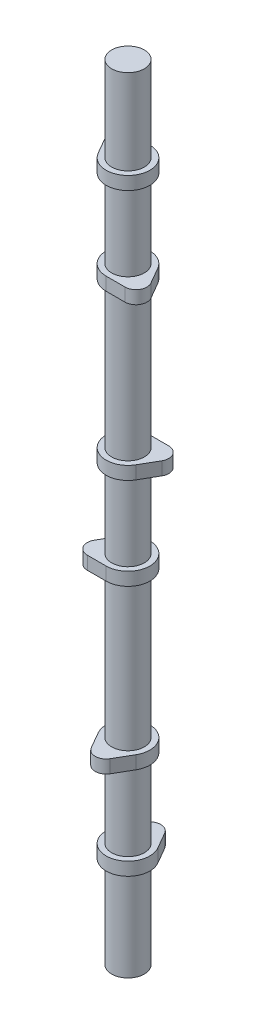
ISO-10303-21;
HEADER;
FILE_DESCRIPTION(('STEP AP214'),'2;1');
FILE_NAME('part.step','',(''),(''),'','','');
FILE_SCHEMA(('AUTOMOTIVE_DESIGN { 1 0 10303 214 1 1 1 1 }'));
ENDSEC;
DATA;
#1=APPLICATION_CONTEXT('core data for automotive mechanical design processes');
#2=APPLICATION_PROTOCOL_DEFINITION('international standard','automotive_design',2000,#1);
#3=PRODUCT_CONTEXT('',#1,'mechanical');
#4=PRODUCT('Part','Part','',(#3));
#5=PRODUCT_RELATED_PRODUCT_CATEGORY('part','',(#4));
#6=PRODUCT_DEFINITION_FORMATION('','',#4);
#7=PRODUCT_DEFINITION_CONTEXT('part definition',#1,'design');
#8=PRODUCT_DEFINITION('design','',#6,#7);
#9=PRODUCT_DEFINITION_SHAPE('','',#8);
#10=(LENGTH_UNIT() NAMED_UNIT(*) SI_UNIT(.MILLI.,.METRE.));
#11=(NAMED_UNIT(*) PLANE_ANGLE_UNIT() SI_UNIT($,.RADIAN.));
#12=(NAMED_UNIT(*) SI_UNIT($,.STERADIAN.) SOLID_ANGLE_UNIT());
#13=UNCERTAINTY_MEASURE_WITH_UNIT(LENGTH_MEASURE(1.E-05),#10,'distance_accuracy_value','');
#14=(GEOMETRIC_REPRESENTATION_CONTEXT(3) GLOBAL_UNCERTAINTY_ASSIGNED_CONTEXT((#13)) GLOBAL_UNIT_ASSIGNED_CONTEXT((#10,
#11,#12)) REPRESENTATION_CONTEXT('',''));
#15=CARTESIAN_POINT('',(0.,0.,0.));
#16=DIRECTION('',(0.,0.,1.));
#17=DIRECTION('',(1.,0.,0.));
#18=AXIS2_PLACEMENT_3D('',#15,#16,#17);
#19=CARTESIAN_POINT('',(0.,353.06,0.));
#20=DIRECTION('',(0.,-1.,0.));
#21=DIRECTION('',(-0.86602540378444,0.,-0.499999999999998));
#22=AXIS2_PLACEMENT_3D('',#19,#20,#21);
#23=CYLINDRICAL_SURFACE('',#22,12.7);
#24=CARTESIAN_POINT('',(0.,345.44,0.));
#25=DIRECTION('',(0.,1.,0.));
#26=DIRECTION('',(0.86602540378444,0.,0.499999999999998));
#27=AXIS2_PLACEMENT_3D('',#24,#25,#26);
#28=CIRCLE('',#27,12.7);
#29=CARTESIAN_POINT('',(-10.9985226280624,345.44,6.35000000000002));
#30=VERTEX_POINT('',#29);
#31=CARTESIAN_POINT('',(0.,345.44,-12.7));
#32=VERTEX_POINT('',#31);
#33=EDGE_CURVE('E129',#30,#32,#28,.T.);
#34=ORIENTED_EDGE('',*,*,#33,.T.);
#35=DIRECTION('',(0.,-1.,0.));
#36=VECTOR('',#35,1.);
#37=CARTESIAN_POINT('',(0.,353.06,-12.7));
#38=LINE('',#37,#36);
#39=CARTESIAN_POINT('',(0.,353.06,-12.7));
#40=VERTEX_POINT('',#39);
#41=EDGE_CURVE('E66',#40,#32,#38,.T.);
#42=ORIENTED_EDGE('',*,*,#41,.F.);
#43=CARTESIAN_POINT('',(0.,353.06,0.));
#44=DIRECTION('',(0.,1.,0.));
#45=DIRECTION('',(0.86602540378444,0.,0.499999999999998));
#46=AXIS2_PLACEMENT_3D('',#43,#44,#45);
#47=CIRCLE('',#46,12.7);
#48=CARTESIAN_POINT('',(-10.9985226280624,353.06,6.35000000000002));
#49=VERTEX_POINT('',#48);
#50=EDGE_CURVE('E111',#49,#40,#47,.T.);
#51=ORIENTED_EDGE('',*,*,#50,.F.);
#52=DIRECTION('',(0.,-1.,0.));
#53=VECTOR('',#52,1.);
#54=CARTESIAN_POINT('',(-10.9985226280624,353.06,6.35000000000002));
#55=LINE('',#54,#53);
#56=EDGE_CURVE('E125',#49,#30,#55,.T.);
#57=ORIENTED_EDGE('',*,*,#56,.T.);
#58=EDGE_LOOP('',(#34,#42,#51,#57));
#59=FACE_BOUND('',#58,.T.);
#60=ADVANCED_FACE('F56',(#59),#23,.T.);
#61=CARTESIAN_POINT('',(-10.9985226280624,353.06,-12.7));
#62=DIRECTION('',(0.,0.,1.));
#63=DIRECTION('',(1.,0.,0.));
#64=AXIS2_PLACEMENT_3D('',#61,#62,#63);
#65=PLANE('',#64);
#66=DIRECTION('',(-1.,0.,0.));
#67=VECTOR('',#66,1.);
#68=CARTESIAN_POINT('',(-10.9985226280624,345.44,-12.7));
#69=LINE('',#68,#67);
#70=CARTESIAN_POINT('',(-10.9985226280624,345.44,-12.7));
#71=VERTEX_POINT('',#70);
#72=EDGE_CURVE('E117',#32,#71,#69,.T.);
#73=ORIENTED_EDGE('',*,*,#72,.T.);
#74=DIRECTION('',(0.,-1.,0.));
#75=VECTOR('',#74,1.);
#76=CARTESIAN_POINT('',(-10.9985226280624,353.06,-12.7));
#77=LINE('',#76,#75);
#78=CARTESIAN_POINT('',(-10.9985226280624,353.06,-12.7));
#79=VERTEX_POINT('',#78);
#80=EDGE_CURVE('E115',#79,#71,#77,.T.);
#81=ORIENTED_EDGE('',*,*,#80,.F.);
#82=DIRECTION('',(-1.,0.,0.));
#83=VECTOR('',#82,1.);
#84=CARTESIAN_POINT('',(-10.9985226280624,353.06,-12.7));
#85=LINE('',#84,#83);
#86=EDGE_CURVE('E106',#40,#79,#85,.T.);
#87=ORIENTED_EDGE('',*,*,#86,.F.);
#88=ORIENTED_EDGE('',*,*,#41,.T.);
#89=EDGE_LOOP('',(#73,#81,#87,#88));
#90=FACE_BOUND('',#89,.T.);
#91=ADVANCED_FACE('F116',(#90),#65,.F.);
#92=CARTESIAN_POINT('',(-10.9985226280624,353.06,-6.34999999999997));
#93=DIRECTION('',(0.,-1.,0.));
#94=DIRECTION('',(-0.86602540378444,0.,-0.499999999999998));
#95=AXIS2_PLACEMENT_3D('',#92,#93,#94);
#96=CYLINDRICAL_SURFACE('',#95,6.35);
#97=CARTESIAN_POINT('',(-10.9985226280624,345.44,-6.34999999999997));
#98=DIRECTION('',(0.,1.,0.));
#99=DIRECTION('',(0.86602540378444,0.,0.499999999999998));
#100=AXIS2_PLACEMENT_3D('',#97,#98,#99);
#101=CIRCLE('',#100,6.35);
#102=CARTESIAN_POINT('',(-16.4977839420936,345.44,-3.17499999999996));
#103=VERTEX_POINT('',#102);
#104=EDGE_CURVE('E92',#71,#103,#101,.T.);
#105=ORIENTED_EDGE('',*,*,#104,.T.);
#106=DIRECTION('',(0.,-1.,0.));
#107=VECTOR('',#106,1.);
#108=CARTESIAN_POINT('',(-16.4977839420936,353.06,-3.17499999999996));
#109=LINE('',#108,#107);
#110=CARTESIAN_POINT('',(-16.4977839420936,353.06,-3.17499999999996));
#111=VERTEX_POINT('',#110);
#112=EDGE_CURVE('E119',#111,#103,#109,.T.);
#113=ORIENTED_EDGE('',*,*,#112,.F.);
#114=CARTESIAN_POINT('',(-10.9985226280624,353.06,-6.34999999999997));
#115=DIRECTION('',(0.,1.,0.));
#116=DIRECTION('',(0.86602540378444,0.,0.499999999999998));
#117=AXIS2_PLACEMENT_3D('',#114,#115,#116);
#118=CIRCLE('',#117,6.35);
#119=EDGE_CURVE('E109',#79,#111,#118,.T.);
#120=ORIENTED_EDGE('',*,*,#119,.F.);
#121=ORIENTED_EDGE('',*,*,#80,.T.);
#122=EDGE_LOOP('',(#105,#113,#120,#121));
#123=FACE_BOUND('',#122,.T.);
#124=ADVANCED_FACE('F121',(#123),#96,.T.);
#125=CARTESIAN_POINT('',(-10.9985226280624,353.06,6.35000000000002));
#126=DIRECTION('',(0.866025403784437,0.,-0.500000000000002));
#127=DIRECTION('',(-0.500000000000002,0.,-0.866025403784438));
#128=AXIS2_PLACEMENT_3D('',#125,#126,#127);
#129=PLANE('',#128);
#130=DIRECTION('',(0.500000000000002,0.,0.866025403784437));
#131=VECTOR('',#130,1.);
#132=CARTESIAN_POINT('',(-10.9985226280624,345.44,6.35000000000002));
#133=LINE('',#132,#131);
#134=EDGE_CURVE('E98',#103,#30,#133,.T.);
#135=ORIENTED_EDGE('',*,*,#134,.T.);
#136=ORIENTED_EDGE('',*,*,#56,.F.);
#137=DIRECTION('',(0.500000000000002,0.,0.866025403784437));
#138=VECTOR('',#137,1.);
#139=CARTESIAN_POINT('',(-10.9985226280624,353.06,6.35000000000002));
#140=LINE('',#139,#138);
#141=EDGE_CURVE('E75',#111,#49,#140,.T.);
#142=ORIENTED_EDGE('',*,*,#141,.F.);
#143=ORIENTED_EDGE('',*,*,#112,.T.);
#144=EDGE_LOOP('',(#135,#136,#142,#143));
#145=FACE_BOUND('',#144,.T.);
#146=ADVANCED_FACE('F158',(#145),#129,.F.);
#147=CARTESIAN_POINT('',(0.,353.06,0.));
#148=DIRECTION('',(0.,1.,0.));
#149=DIRECTION('',(0.86602540378444,0.,0.499999999999998));
#150=AXIS2_PLACEMENT_3D('',#147,#148,#149);
#151=PLANE('',#150);
#152=CARTESIAN_POINT('',(0.,353.06,0.));
#153=DIRECTION('',(0.,1.,0.));
#154=DIRECTION('',(0.,0.,1.));
#155=AXIS2_PLACEMENT_3D('',#152,#153,#154);
#156=CIRCLE('',#155,9.5);
#157=CARTESIAN_POINT('',(0.,353.06,9.5));
#158=VERTEX_POINT('',#157);
#159=EDGE_CURVE('E12',#158,#158,#156,.T.);
#160=ORIENTED_EDGE('',*,*,#159,.F.);
#161=EDGE_LOOP('',(#160));
#162=FACE_BOUND('',#161,.T.);
#163=ORIENTED_EDGE('',*,*,#50,.T.);
#164=ORIENTED_EDGE('',*,*,#86,.T.);
#165=ORIENTED_EDGE('',*,*,#119,.T.);
#166=ORIENTED_EDGE('',*,*,#141,.T.);
#167=EDGE_LOOP('',(#163,#164,#165,#166));
#168=FACE_BOUND('',#167,.T.);
#169=ADVANCED_FACE('F107',(#162,#168),#151,.T.);
#170=CARTESIAN_POINT('',(0.,345.44,0.));
#171=DIRECTION('',(0.,1.,0.));
#172=DIRECTION('',(0.86602540378444,0.,0.499999999999998));
#173=AXIS2_PLACEMENT_3D('',#170,#171,#172);
#174=PLANE('',#173);
#175=CARTESIAN_POINT('',(0.,345.44,0.));
#176=DIRECTION('',(0.,1.,0.));
#177=DIRECTION('',(0.,0.,1.));
#178=AXIS2_PLACEMENT_3D('',#175,#176,#177);
#179=CIRCLE('',#178,9.5);
#180=CARTESIAN_POINT('',(0.,345.44,9.5));
#181=VERTEX_POINT('',#180);
#182=EDGE_CURVE('E59',#181,#181,#179,.T.);
#183=ORIENTED_EDGE('',*,*,#182,.T.);
#184=EDGE_LOOP('',(#183));
#185=FACE_BOUND('',#184,.T.);
#186=ORIENTED_EDGE('',*,*,#33,.F.);
#187=ORIENTED_EDGE('',*,*,#134,.F.);
#188=ORIENTED_EDGE('',*,*,#104,.F.);
#189=ORIENTED_EDGE('',*,*,#72,.F.);
#190=EDGE_LOOP('',(#186,#187,#188,#189));
#191=FACE_BOUND('',#190,.T.);
#192=ADVANCED_FACE('F146',(#185,#191),#174,.F.);
#193=CARTESIAN_POINT('',(0.,-53.4999999999999,0.));
#194=DIRECTION('',(0.,1.,0.));
#195=DIRECTION('',(0.,0.,1.));
#196=AXIS2_PLACEMENT_3D('',#193,#194,#195);
#197=PLANE('',#196);
#198=CARTESIAN_POINT('',(0.,-53.4999999999999,0.));
#199=DIRECTION('',(0.,1.,0.));
#200=DIRECTION('',(0.,0.,1.));
#201=AXIS2_PLACEMENT_3D('',#198,#199,#200);
#202=CIRCLE('',#201,9.5);
#203=CARTESIAN_POINT('',(0.,-53.4999999999999,9.5));
#204=VERTEX_POINT('',#203);
#205=EDGE_CURVE('E225',#204,#204,#202,.T.);
#206=ORIENTED_EDGE('',*,*,#205,.F.);
#207=EDGE_LOOP('',(#206));
#208=FACE_BOUND('',#207,.T.);
#209=ADVANCED_FACE('F148',(#208),#197,.F.);
#210=CARTESIAN_POINT('',(0.,-53.4999999999999,0.));
#211=DIRECTION('',(0.,1.,0.));
#212=DIRECTION('',(0.,0.,1.));
#213=AXIS2_PLACEMENT_3D('',#210,#211,#212);
#214=CYLINDRICAL_SURFACE('',#213,9.5);
#215=ORIENTED_EDGE('',*,*,#205,.T.);
#216=EDGE_LOOP('',(#215));
#217=FACE_BOUND('',#216,.T.);
#218=ORIENTED_EDGE('',*,*,#182,.F.);
#219=EDGE_LOOP('',(#218));
#220=FACE_BOUND('',#219,.T.);
#221=ADVANCED_FACE('F155',(#217,#220),#214,.T.);
#222=ORIENTED_EDGE('',*,*,#159,.T.);
#223=EDGE_LOOP('',(#222));
#224=FACE_BOUND('',#223,.T.);
#225=CARTESIAN_POINT('',(0.,402.59,0.));
#226=DIRECTION('',(0.,1.,0.));
#227=DIRECTION('',(0.,0.,1.));
#228=AXIS2_PLACEMENT_3D('',#225,#226,#227);
#229=CIRCLE('',#228,9.5);
#230=CARTESIAN_POINT('',(0.,402.59,9.5));
#231=VERTEX_POINT('',#230);
#232=EDGE_CURVE('E222',#231,#231,#229,.T.);
#233=ORIENTED_EDGE('',*,*,#232,.F.);
#234=EDGE_LOOP('',(#233));
#235=FACE_BOUND('',#234,.T.);
#236=ADVANCED_FACE('F196',(#224,#235),#214,.T.);
#237=CARTESIAN_POINT('',(0.,402.59,0.));
#238=DIRECTION('',(0.,1.,0.));
#239=DIRECTION('',(0.,0.,1.));
#240=AXIS2_PLACEMENT_3D('',#237,#238,#239);
#241=PLANE('',#240);
#242=ORIENTED_EDGE('',*,*,#232,.T.);
#243=EDGE_LOOP('',(#242));
#244=FACE_BOUND('',#243,.T.);
#245=ADVANCED_FACE('F205',(#244),#241,.T.);
#246=CLOSED_SHELL('',(#60,#91,#124,#146,#169,#192,#209,#221,#236,#245));
#247=MANIFOLD_SOLID_BREP('B2',#246);
#248=CARTESIAN_POINT('',(0.,299.72,0.));
#249=DIRECTION('',(0.,-1.,0.));
#250=DIRECTION('',(0.866025403784443,0.,0.499999999999992));
#251=AXIS2_PLACEMENT_3D('',#248,#249,#250);
#252=CYLINDRICAL_SURFACE('',#251,12.7);
#253=CARTESIAN_POINT('',(0.,292.1,0.));
#254=DIRECTION('',(0.,1.,0.));
#255=DIRECTION('',(-0.866025403784443,0.,-0.499999999999992));
#256=AXIS2_PLACEMENT_3D('',#253,#254,#255);
#257=CIRCLE('',#256,12.7);
#258=CARTESIAN_POINT('',(10.9985226280623,292.1,-6.3500000000001));
#259=VERTEX_POINT('',#258);
#260=CARTESIAN_POINT('',(1.16226472890446E-13,292.1,12.7));
#261=VERTEX_POINT('',#260);
#262=EDGE_CURVE('E328',#259,#261,#257,.T.);
#263=ORIENTED_EDGE('',*,*,#262,.T.);
#264=DIRECTION('',(0.,-1.,0.));
#265=VECTOR('',#264,1.);
#266=CARTESIAN_POINT('',(1.16226472890446E-13,299.72,12.7));
#267=LINE('',#266,#265);
#268=CARTESIAN_POINT('',(1.16226472890446E-13,299.72,12.7));
#269=VERTEX_POINT('',#268);
#270=EDGE_CURVE('E54',#269,#261,#267,.T.);
#271=ORIENTED_EDGE('',*,*,#270,.F.);
#272=CARTESIAN_POINT('',(0.,299.72,0.));
#273=DIRECTION('',(0.,1.,0.));
#274=DIRECTION('',(-0.866025403784443,0.,-0.499999999999992));
#275=AXIS2_PLACEMENT_3D('',#272,#273,#274);
#276=CIRCLE('',#275,12.7);
#277=CARTESIAN_POINT('',(10.9985226280623,299.72,-6.3500000000001));
#278=VERTEX_POINT('',#277);
#279=EDGE_CURVE('E316',#278,#269,#276,.T.);
#280=ORIENTED_EDGE('',*,*,#279,.F.);
#281=DIRECTION('',(0.,-1.,0.));
#282=VECTOR('',#281,1.);
#283=CARTESIAN_POINT('',(10.9985226280623,299.72,-6.3500000000001));
#284=LINE('',#283,#282);
#285=EDGE_CURVE('E324',#278,#259,#284,.T.);
#286=ORIENTED_EDGE('',*,*,#285,.T.);
#287=EDGE_LOOP('',(#263,#271,#280,#286));
#288=FACE_BOUND('',#287,.T.);
#289=ADVANCED_FACE('F265',(#288),#252,.T.);
#290=CARTESIAN_POINT('',(10.9985226280625,299.72,12.6999999999999));
#291=DIRECTION('',(0.,0.,-1.));
#292=DIRECTION('',(-1.,0.,0.));
#293=AXIS2_PLACEMENT_3D('',#290,#291,#292);
#294=PLANE('',#293);
#295=DIRECTION('',(1.,0.,0.));
#296=VECTOR('',#295,1.);
#297=CARTESIAN_POINT('',(10.9985226280625,292.1,12.6999999999999));
#298=LINE('',#297,#296);
#299=CARTESIAN_POINT('',(10.9985226280625,292.1,12.6999999999999));
#300=VERTEX_POINT('',#299);
#301=EDGE_CURVE('E320',#261,#300,#298,.T.);
#302=ORIENTED_EDGE('',*,*,#301,.T.);
#303=DIRECTION('',(0.,-1.,0.));
#304=VECTOR('',#303,1.);
#305=CARTESIAN_POINT('',(10.9985226280625,299.72,12.6999999999999));
#306=LINE('',#305,#304);
#307=CARTESIAN_POINT('',(10.9985226280625,299.72,12.6999999999999));
#308=VERTEX_POINT('',#307);
#309=EDGE_CURVE('E273',#308,#300,#306,.T.);
#310=ORIENTED_EDGE('',*,*,#309,.F.);
#311=DIRECTION('',(1.,0.,0.));
#312=VECTOR('',#311,1.);
#313=CARTESIAN_POINT('',(10.9985226280625,299.72,12.6999999999999));
#314=LINE('',#313,#312);
#315=EDGE_CURVE('E311',#269,#308,#314,.T.);
#316=ORIENTED_EDGE('',*,*,#315,.F.);
#317=ORIENTED_EDGE('',*,*,#270,.T.);
#318=EDGE_LOOP('',(#302,#310,#316,#317));
#319=FACE_BOUND('',#318,.T.);
#320=ADVANCED_FACE('F319',(#319),#294,.F.);
#321=CARTESIAN_POINT('',(10.9985226280624,299.72,6.3499999999999));
#322=DIRECTION('',(0.,-1.,0.));
#323=DIRECTION('',(0.866025403784443,0.,0.499999999999992));
#324=AXIS2_PLACEMENT_3D('',#321,#322,#323);
#325=CYLINDRICAL_SURFACE('',#324,6.35);
#326=CARTESIAN_POINT('',(10.9985226280624,292.1,6.3499999999999));
#327=DIRECTION('',(0.,1.,0.));
#328=DIRECTION('',(-0.866025403784443,0.,-0.499999999999992));
#329=AXIS2_PLACEMENT_3D('',#326,#327,#328);
#330=CIRCLE('',#329,6.35);
#331=CARTESIAN_POINT('',(16.4977839420936,292.1,3.17499999999985));
#332=VERTEX_POINT('',#331);
#333=EDGE_CURVE('E298',#300,#332,#330,.T.);
#334=ORIENTED_EDGE('',*,*,#333,.T.);
#335=DIRECTION('',(0.,-1.,0.));
#336=VECTOR('',#335,1.);
#337=CARTESIAN_POINT('',(16.4977839420936,299.72,3.17499999999985));
#338=LINE('',#337,#336);
#339=CARTESIAN_POINT('',(16.4977839420936,299.72,3.17499999999985));
#340=VERTEX_POINT('',#339);
#341=EDGE_CURVE('E321',#340,#332,#338,.T.);
#342=ORIENTED_EDGE('',*,*,#341,.F.);
#343=CARTESIAN_POINT('',(10.9985226280624,299.72,6.3499999999999));
#344=DIRECTION('',(0.,1.,0.));
#345=DIRECTION('',(-0.866025403784443,0.,-0.499999999999992));
#346=AXIS2_PLACEMENT_3D('',#343,#344,#345);
#347=CIRCLE('',#346,6.35);
#348=EDGE_CURVE('E314',#308,#340,#347,.T.);
#349=ORIENTED_EDGE('',*,*,#348,.F.);
#350=ORIENTED_EDGE('',*,*,#309,.T.);
#351=EDGE_LOOP('',(#334,#342,#349,#350));
#352=FACE_BOUND('',#351,.T.);
#353=ADVANCED_FACE('F322',(#352),#325,.T.);
#354=CARTESIAN_POINT('',(10.9985226280623,299.72,-6.3500000000001));
#355=DIRECTION('',(-0.866025403784434,0.,0.500000000000008));
#356=DIRECTION('',(0.500000000000008,0.,0.866025403784434));
#357=AXIS2_PLACEMENT_3D('',#354,#355,#356);
#358=PLANE('',#357);
#359=DIRECTION('',(-0.500000000000008,0.,-0.866025403784434));
#360=VECTOR('',#359,1.);
#361=CARTESIAN_POINT('',(10.9985226280623,292.1,-6.3500000000001));
#362=LINE('',#361,#360);
#363=EDGE_CURVE('E304',#332,#259,#362,.T.);
#364=ORIENTED_EDGE('',*,*,#363,.T.);
#365=ORIENTED_EDGE('',*,*,#285,.F.);
#366=DIRECTION('',(-0.500000000000008,0.,-0.866025403784434));
#367=VECTOR('',#366,1.);
#368=CARTESIAN_POINT('',(10.9985226280623,299.72,-6.3500000000001));
#369=LINE('',#368,#367);
#370=EDGE_CURVE('E281',#340,#278,#369,.T.);
#371=ORIENTED_EDGE('',*,*,#370,.F.);
#372=ORIENTED_EDGE('',*,*,#341,.T.);
#373=EDGE_LOOP('',(#364,#365,#371,#372));
#374=FACE_BOUND('',#373,.T.);
#375=ADVANCED_FACE('F335',(#374),#358,.F.);
#376=CARTESIAN_POINT('',(0.,299.72,0.));
#377=DIRECTION('',(0.,1.,0.));
#378=DIRECTION('',(-0.866025403784443,0.,-0.499999999999992));
#379=AXIS2_PLACEMENT_3D('',#376,#377,#378);
#380=PLANE('',#379);
#381=ORIENTED_EDGE('',*,*,#279,.T.);
#382=ORIENTED_EDGE('',*,*,#315,.T.);
#383=ORIENTED_EDGE('',*,*,#348,.T.);
#384=ORIENTED_EDGE('',*,*,#370,.T.);
#385=EDGE_LOOP('',(#381,#382,#383,#384));
#386=FACE_BOUND('',#385,.T.);
#387=ADVANCED_FACE('F312',(#386),#380,.T.);
#388=CARTESIAN_POINT('',(0.,292.1,0.));
#389=DIRECTION('',(0.,1.,0.));
#390=DIRECTION('',(-0.866025403784443,0.,-0.499999999999992));
#391=AXIS2_PLACEMENT_3D('',#388,#389,#390);
#392=PLANE('',#391);
#393=ORIENTED_EDGE('',*,*,#262,.F.);
#394=ORIENTED_EDGE('',*,*,#363,.F.);
#395=ORIENTED_EDGE('',*,*,#333,.F.);
#396=ORIENTED_EDGE('',*,*,#301,.F.);
#397=EDGE_LOOP('',(#393,#394,#395,#396));
#398=FACE_BOUND('',#397,.T.);
#399=ADVANCED_FACE('F338',(#398),#392,.F.);
#400=CLOSED_SHELL('',(#289,#320,#353,#375,#387,#399));
#401=MANIFOLD_SOLID_BREP('B6',#400);
#402=CARTESIAN_POINT('',(0.,207.01,0.));
#403=DIRECTION('',(0.,-1.,0.));
#404=DIRECTION('',(0.866025403784419,0.,-0.500000000000034));
#405=AXIS2_PLACEMENT_3D('',#402,#403,#404);
#406=CYLINDRICAL_SURFACE('',#405,12.7);
#407=CARTESIAN_POINT('',(0.,199.39,0.));
#408=DIRECTION('',(0.,1.,0.));
#409=DIRECTION('',(-0.866025403784419,0.,0.500000000000034));
#410=AXIS2_PLACEMENT_3D('',#407,#408,#409);
#411=CIRCLE('',#410,12.7);
#412=CARTESIAN_POINT('',(-4.9960036108132E-13,199.39,-12.7));
#413=VERTEX_POINT('',#412);
#414=CARTESIAN_POINT('',(10.9985226280626,199.39,6.34999999999957));
#415=VERTEX_POINT('',#414);
#416=EDGE_CURVE('E462',#413,#415,#411,.T.);
#417=ORIENTED_EDGE('',*,*,#416,.T.);
#418=DIRECTION('',(0.,-1.,0.));
#419=VECTOR('',#418,1.);
#420=CARTESIAN_POINT('',(10.9985226280626,207.01,6.34999999999957));
#421=LINE('',#420,#419);
#422=CARTESIAN_POINT('',(10.9985226280626,207.01,6.34999999999957));
#423=VERTEX_POINT('',#422);
#424=EDGE_CURVE('E263',#423,#415,#421,.T.);
#425=ORIENTED_EDGE('',*,*,#424,.F.);
#426=CARTESIAN_POINT('',(0.,207.01,0.));
#427=DIRECTION('',(0.,1.,0.));
#428=DIRECTION('',(-0.866025403784419,0.,0.500000000000034));
#429=AXIS2_PLACEMENT_3D('',#426,#427,#428);
#430=CIRCLE('',#429,12.7);
#431=CARTESIAN_POINT('',(-4.9960036108132E-13,207.01,-12.7));
#432=VERTEX_POINT('',#431);
#433=EDGE_CURVE('E450',#432,#423,#430,.T.);
#434=ORIENTED_EDGE('',*,*,#433,.F.);
#435=DIRECTION('',(0.,-1.,0.));
#436=VECTOR('',#435,1.);
#437=CARTESIAN_POINT('',(-4.9960036108132E-13,207.01,-12.7));
#438=LINE('',#437,#436);
#439=EDGE_CURVE('E458',#432,#413,#438,.T.);
#440=ORIENTED_EDGE('',*,*,#439,.T.);
#441=EDGE_LOOP('',(#417,#425,#434,#440));
#442=FACE_BOUND('',#441,.T.);
#443=ADVANCED_FACE('F399',(#442),#406,.T.);
#444=CARTESIAN_POINT('',(16.4977839420934,207.01,-3.17500000000065));
#445=DIRECTION('',(-0.866025403784458,0.,-0.499999999999966));
#446=DIRECTION('',(-0.499999999999966,0.,0.866025403784458));
#447=AXIS2_PLACEMENT_3D('',#444,#445,#446);
#448=PLANE('',#447);
#449=DIRECTION('',(0.499999999999966,0.,-0.866025403784458));
#450=VECTOR('',#449,1.);
#451=CARTESIAN_POINT('',(16.4977839420934,199.39,-3.17500000000065));
#452=LINE('',#451,#450);
#453=CARTESIAN_POINT('',(16.4977839420934,199.39,-3.17500000000065));
#454=VERTEX_POINT('',#453);
#455=EDGE_CURVE('E454',#415,#454,#452,.T.);
#456=ORIENTED_EDGE('',*,*,#455,.T.);
#457=DIRECTION('',(0.,-1.,0.));
#458=VECTOR('',#457,1.);
#459=CARTESIAN_POINT('',(16.4977839420934,207.01,-3.17500000000065));
#460=LINE('',#459,#458);
#461=CARTESIAN_POINT('',(16.4977839420934,207.01,-3.17500000000065));
#462=VERTEX_POINT('',#461);
#463=EDGE_CURVE('E407',#462,#454,#460,.T.);
#464=ORIENTED_EDGE('',*,*,#463,.F.);
#465=DIRECTION('',(0.499999999999966,0.,-0.866025403784458));
#466=VECTOR('',#465,1.);
#467=CARTESIAN_POINT('',(16.4977839420934,207.01,-3.17500000000065));
#468=LINE('',#467,#466);
#469=EDGE_CURVE('E445',#423,#462,#468,.T.);
#470=ORIENTED_EDGE('',*,*,#469,.F.);
#471=ORIENTED_EDGE('',*,*,#424,.T.);
#472=EDGE_LOOP('',(#456,#464,#470,#471));
#473=FACE_BOUND('',#472,.T.);
#474=ADVANCED_FACE('F453',(#473),#448,.F.);
#475=CARTESIAN_POINT('',(10.9985226280621,207.01,-6.35000000000043));
#476=DIRECTION('',(0.,-1.,0.));
#477=DIRECTION('',(0.866025403784419,0.,-0.500000000000034));
#478=AXIS2_PLACEMENT_3D('',#475,#476,#477);
#479=CYLINDRICAL_SURFACE('',#478,6.35);
#480=CARTESIAN_POINT('',(10.9985226280621,199.39,-6.35000000000043));
#481=DIRECTION('',(0.,1.,0.));
#482=DIRECTION('',(-0.866025403784419,0.,0.500000000000034));
#483=AXIS2_PLACEMENT_3D('',#480,#481,#482);
#484=CIRCLE('',#483,6.35);
#485=CARTESIAN_POINT('',(10.9985226280619,199.39,-12.7000000000004));
#486=VERTEX_POINT('',#485);
#487=EDGE_CURVE('E432',#454,#486,#484,.T.);
#488=ORIENTED_EDGE('',*,*,#487,.T.);
#489=DIRECTION('',(0.,-1.,0.));
#490=VECTOR('',#489,1.);
#491=CARTESIAN_POINT('',(10.9985226280619,207.01,-12.7000000000004));
#492=LINE('',#491,#490);
#493=CARTESIAN_POINT('',(10.9985226280619,207.01,-12.7000000000004));
#494=VERTEX_POINT('',#493);
#495=EDGE_CURVE('E455',#494,#486,#492,.T.);
#496=ORIENTED_EDGE('',*,*,#495,.F.);
#497=CARTESIAN_POINT('',(10.9985226280621,207.01,-6.35000000000043));
#498=DIRECTION('',(0.,1.,0.));
#499=DIRECTION('',(-0.866025403784419,0.,0.500000000000034));
#500=AXIS2_PLACEMENT_3D('',#497,#498,#499);
#501=CIRCLE('',#500,6.35);
#502=EDGE_CURVE('E448',#462,#494,#501,.T.);
#503=ORIENTED_EDGE('',*,*,#502,.F.);
#504=ORIENTED_EDGE('',*,*,#463,.T.);
#505=EDGE_LOOP('',(#488,#496,#503,#504));
#506=FACE_BOUND('',#505,.T.);
#507=ADVANCED_FACE('F456',(#506),#479,.T.);
#508=CARTESIAN_POINT('',(-4.9960036108132E-13,207.01,-12.7));
#509=DIRECTION('',(0.,0.,1.));
#510=DIRECTION('',(1.,0.,0.));
#511=AXIS2_PLACEMENT_3D('',#508,#509,#510);
#512=PLANE('',#511);
#513=DIRECTION('',(-1.,0.,0.));
#514=VECTOR('',#513,1.);
#515=CARTESIAN_POINT('',(-4.9960036108132E-13,199.39,-12.7));
#516=LINE('',#515,#514);
#517=EDGE_CURVE('E438',#486,#413,#516,.T.);
#518=ORIENTED_EDGE('',*,*,#517,.T.);
#519=ORIENTED_EDGE('',*,*,#439,.F.);
#520=DIRECTION('',(-1.,0.,0.));
#521=VECTOR('',#520,1.);
#522=CARTESIAN_POINT('',(-4.9960036108132E-13,207.01,-12.7));
#523=LINE('',#522,#521);
#524=EDGE_CURVE('E415',#494,#432,#523,.T.);
#525=ORIENTED_EDGE('',*,*,#524,.F.);
#526=ORIENTED_EDGE('',*,*,#495,.T.);
#527=EDGE_LOOP('',(#518,#519,#525,#526));
#528=FACE_BOUND('',#527,.T.);
#529=ADVANCED_FACE('F469',(#528),#512,.F.);
#530=CARTESIAN_POINT('',(0.,207.01,0.));
#531=DIRECTION('',(0.,1.,0.));
#532=DIRECTION('',(-0.866025403784419,0.,0.500000000000034));
#533=AXIS2_PLACEMENT_3D('',#530,#531,#532);
#534=PLANE('',#533);
#535=ORIENTED_EDGE('',*,*,#433,.T.);
#536=ORIENTED_EDGE('',*,*,#469,.T.);
#537=ORIENTED_EDGE('',*,*,#502,.T.);
#538=ORIENTED_EDGE('',*,*,#524,.T.);
#539=EDGE_LOOP('',(#535,#536,#537,#538));
#540=FACE_BOUND('',#539,.T.);
#541=ADVANCED_FACE('F446',(#540),#534,.T.);
#542=CARTESIAN_POINT('',(0.,199.39,0.));
#543=DIRECTION('',(0.,1.,0.));
#544=DIRECTION('',(-0.866025403784419,0.,0.500000000000034));
#545=AXIS2_PLACEMENT_3D('',#542,#543,#544);
#546=PLANE('',#545);
#547=ORIENTED_EDGE('',*,*,#416,.F.);
#548=ORIENTED_EDGE('',*,*,#517,.F.);
#549=ORIENTED_EDGE('',*,*,#487,.F.);
#550=ORIENTED_EDGE('',*,*,#455,.F.);
#551=EDGE_LOOP('',(#547,#548,#549,#550));
#552=FACE_BOUND('',#551,.T.);
#553=ADVANCED_FACE('F472',(#552),#546,.F.);
#554=CLOSED_SHELL('',(#443,#474,#507,#529,#541,#553));
#555=MANIFOLD_SOLID_BREP('B48',#554);
#556=CARTESIAN_POINT('',(0.,153.67,0.));
#557=DIRECTION('',(0.,-1.,0.));
#558=DIRECTION('',(-0.866025403784415,0.,0.50000000000004));
#559=AXIS2_PLACEMENT_3D('',#556,#557,#558);
#560=CYLINDRICAL_SURFACE('',#559,12.7);
#561=CARTESIAN_POINT('',(0.,146.05,0.));
#562=DIRECTION('',(0.,1.,0.));
#563=DIRECTION('',(0.866025403784415,0.,-0.50000000000004));
#564=AXIS2_PLACEMENT_3D('',#561,#562,#563);
#565=CIRCLE('',#564,12.7);
#566=CARTESIAN_POINT('',(5.88938620094126E-13,146.05,12.7));
#567=VERTEX_POINT('',#566);
#568=CARTESIAN_POINT('',(-10.9985226280627,146.05,-6.34999999999949));
#569=VERTEX_POINT('',#568);
#570=EDGE_CURVE('E596',#567,#569,#565,.T.);
#571=ORIENTED_EDGE('',*,*,#570,.T.);
#572=DIRECTION('',(0.,-1.,0.));
#573=VECTOR('',#572,1.);
#574=CARTESIAN_POINT('',(-10.9985226280627,153.67,-6.34999999999949));
#575=LINE('',#574,#573);
#576=CARTESIAN_POINT('',(-10.9985226280627,153.67,-6.34999999999949));
#577=VERTEX_POINT('',#576);
#578=EDGE_CURVE('E397',#577,#569,#575,.T.);
#579=ORIENTED_EDGE('',*,*,#578,.F.);
#580=CARTESIAN_POINT('',(0.,153.67,0.));
#581=DIRECTION('',(0.,1.,0.));
#582=DIRECTION('',(0.866025403784415,0.,-0.50000000000004));
#583=AXIS2_PLACEMENT_3D('',#580,#581,#582);
#584=CIRCLE('',#583,12.7);
#585=CARTESIAN_POINT('',(5.88938620094126E-13,153.67,12.7));
#586=VERTEX_POINT('',#585);
#587=EDGE_CURVE('E584',#586,#577,#584,.T.);
#588=ORIENTED_EDGE('',*,*,#587,.F.);
#589=DIRECTION('',(0.,-1.,0.));
#590=VECTOR('',#589,1.);
#591=CARTESIAN_POINT('',(5.88938620094126E-13,153.67,12.7));
#592=LINE('',#591,#590);
#593=EDGE_CURVE('E592',#586,#567,#592,.T.);
#594=ORIENTED_EDGE('',*,*,#593,.T.);
#595=EDGE_LOOP('',(#571,#579,#588,#594));
#596=FACE_BOUND('',#595,.T.);
#597=ADVANCED_FACE('F533',(#596),#560,.T.);
#598=CARTESIAN_POINT('',(-16.4977839420934,153.67,3.17500000000077));
#599=DIRECTION('',(0.866025403784462,0.,0.49999999999996));
#600=DIRECTION('',(0.49999999999996,0.,-0.866025403784462));
#601=AXIS2_PLACEMENT_3D('',#598,#599,#600);
#602=PLANE('',#601);
#603=DIRECTION('',(-0.49999999999996,0.,0.866025403784462));
#604=VECTOR('',#603,1.);
#605=CARTESIAN_POINT('',(-16.4977839420934,146.05,3.17500000000077));
#606=LINE('',#605,#604);
#607=CARTESIAN_POINT('',(-16.4977839420934,146.05,3.17500000000077));
#608=VERTEX_POINT('',#607);
#609=EDGE_CURVE('E588',#569,#608,#606,.T.);
#610=ORIENTED_EDGE('',*,*,#609,.T.);
#611=DIRECTION('',(0.,-1.,0.));
#612=VECTOR('',#611,1.);
#613=CARTESIAN_POINT('',(-16.4977839420934,153.67,3.17500000000077));
#614=LINE('',#613,#612);
#615=CARTESIAN_POINT('',(-16.4977839420934,153.67,3.17500000000077));
#616=VERTEX_POINT('',#615);
#617=EDGE_CURVE('E541',#616,#608,#614,.T.);
#618=ORIENTED_EDGE('',*,*,#617,.F.);
#619=DIRECTION('',(-0.49999999999996,0.,0.866025403784462));
#620=VECTOR('',#619,1.);
#621=CARTESIAN_POINT('',(-16.4977839420934,153.67,3.17500000000077));
#622=LINE('',#621,#620);
#623=EDGE_CURVE('E579',#577,#616,#622,.T.);
#624=ORIENTED_EDGE('',*,*,#623,.F.);
#625=ORIENTED_EDGE('',*,*,#578,.T.);
#626=EDGE_LOOP('',(#610,#618,#624,#625));
#627=FACE_BOUND('',#626,.T.);
#628=ADVANCED_FACE('F587',(#627),#602,.F.);
#629=CARTESIAN_POINT('',(-10.9985226280621,153.67,6.35000000000051));
#630=DIRECTION('',(0.,-1.,0.));
#631=DIRECTION('',(-0.866025403784415,0.,0.50000000000004));
#632=AXIS2_PLACEMENT_3D('',#629,#630,#631);
#633=CYLINDRICAL_SURFACE('',#632,6.35);
#634=CARTESIAN_POINT('',(-10.9985226280621,146.05,6.35000000000051));
#635=DIRECTION('',(0.,1.,0.));
#636=DIRECTION('',(0.866025403784415,0.,-0.50000000000004));
#637=AXIS2_PLACEMENT_3D('',#634,#635,#636);
#638=CIRCLE('',#637,6.35);
#639=CARTESIAN_POINT('',(-10.9985226280618,146.05,12.7000000000005));
#640=VERTEX_POINT('',#639);
#641=EDGE_CURVE('E566',#608,#640,#638,.T.);
#642=ORIENTED_EDGE('',*,*,#641,.T.);
#643=DIRECTION('',(0.,-1.,0.));
#644=VECTOR('',#643,1.);
#645=CARTESIAN_POINT('',(-10.9985226280618,153.67,12.7000000000005));
#646=LINE('',#645,#644);
#647=CARTESIAN_POINT('',(-10.9985226280618,153.67,12.7000000000005));
#648=VERTEX_POINT('',#647);
#649=EDGE_CURVE('E589',#648,#640,#646,.T.);
#650=ORIENTED_EDGE('',*,*,#649,.F.);
#651=CARTESIAN_POINT('',(-10.9985226280621,153.67,6.35000000000051));
#652=DIRECTION('',(0.,1.,0.));
#653=DIRECTION('',(0.866025403784415,0.,-0.50000000000004));
#654=AXIS2_PLACEMENT_3D('',#651,#652,#653);
#655=CIRCLE('',#654,6.35);
#656=EDGE_CURVE('E582',#616,#648,#655,.T.);
#657=ORIENTED_EDGE('',*,*,#656,.F.);
#658=ORIENTED_EDGE('',*,*,#617,.T.);
#659=EDGE_LOOP('',(#642,#650,#657,#658));
#660=FACE_BOUND('',#659,.T.);
#661=ADVANCED_FACE('F590',(#660),#633,.T.);
#662=CARTESIAN_POINT('',(5.88938620094126E-13,153.67,12.7));
#663=DIRECTION('',(0.,0.,-1.));
#664=DIRECTION('',(-1.,0.,0.));
#665=AXIS2_PLACEMENT_3D('',#662,#663,#664);
#666=PLANE('',#665);
#667=DIRECTION('',(1.,0.,0.));
#668=VECTOR('',#667,1.);
#669=CARTESIAN_POINT('',(5.88938620094126E-13,146.05,12.7));
#670=LINE('',#669,#668);
#671=EDGE_CURVE('E572',#640,#567,#670,.T.);
#672=ORIENTED_EDGE('',*,*,#671,.T.);
#673=ORIENTED_EDGE('',*,*,#593,.F.);
#674=DIRECTION('',(1.,0.,0.));
#675=VECTOR('',#674,1.);
#676=CARTESIAN_POINT('',(5.88938620094126E-13,153.67,12.7));
#677=LINE('',#676,#675);
#678=EDGE_CURVE('E549',#648,#586,#677,.T.);
#679=ORIENTED_EDGE('',*,*,#678,.F.);
#680=ORIENTED_EDGE('',*,*,#649,.T.);
#681=EDGE_LOOP('',(#672,#673,#679,#680));
#682=FACE_BOUND('',#681,.T.);
#683=ADVANCED_FACE('F603',(#682),#666,.F.);
#684=CARTESIAN_POINT('',(0.,153.67,0.));
#685=DIRECTION('',(0.,1.,0.));
#686=DIRECTION('',(0.866025403784415,0.,-0.50000000000004));
#687=AXIS2_PLACEMENT_3D('',#684,#685,#686);
#688=PLANE('',#687);
#689=ORIENTED_EDGE('',*,*,#587,.T.);
#690=ORIENTED_EDGE('',*,*,#623,.T.);
#691=ORIENTED_EDGE('',*,*,#656,.T.);
#692=ORIENTED_EDGE('',*,*,#678,.T.);
#693=EDGE_LOOP('',(#689,#690,#691,#692));
#694=FACE_BOUND('',#693,.T.);
#695=ADVANCED_FACE('F580',(#694),#688,.T.);
#696=CARTESIAN_POINT('',(0.,146.05,0.));
#697=DIRECTION('',(0.,1.,0.));
#698=DIRECTION('',(0.866025403784415,0.,-0.50000000000004));
#699=AXIS2_PLACEMENT_3D('',#696,#697,#698);
#700=PLANE('',#699);
#701=ORIENTED_EDGE('',*,*,#570,.F.);
#702=ORIENTED_EDGE('',*,*,#671,.F.);
#703=ORIENTED_EDGE('',*,*,#641,.F.);
#704=ORIENTED_EDGE('',*,*,#609,.F.);
#705=EDGE_LOOP('',(#701,#702,#703,#704));
#706=FACE_BOUND('',#705,.T.);
#707=ADVANCED_FACE('F606',(#706),#700,.F.);
#708=CLOSED_SHELL('',(#597,#628,#661,#683,#695,#707));
#709=MANIFOLD_SOLID_BREP('B257',#708);
#710=CARTESIAN_POINT('',(0.,60.96,0.));
#711=DIRECTION('',(0.,-1.,0.));
#712=DIRECTION('',(0.,0.,1.));
#713=AXIS2_PLACEMENT_3D('',#710,#711,#712);
#714=CYLINDRICAL_SURFACE('',#713,12.7);
#715=CARTESIAN_POINT('',(0.,53.34,0.));
#716=DIRECTION('',(0.,1.,0.));
#717=DIRECTION('',(0.,0.,-1.));
#718=AXIS2_PLACEMENT_3D('',#715,#716,#717);
#719=CIRCLE('',#718,12.7);
#720=CARTESIAN_POINT('',(10.9985226280623,53.34,6.35000000000008));
#721=VERTEX_POINT('',#720);
#722=CARTESIAN_POINT('',(-10.9985226280624,53.34,6.34999999999992));
#723=VERTEX_POINT('',#722);
#724=EDGE_CURVE('E729',#721,#723,#719,.T.);
#725=ORIENTED_EDGE('',*,*,#724,.T.);
#726=DIRECTION('',(0.,-1.,0.));
#727=VECTOR('',#726,1.);
#728=CARTESIAN_POINT('',(-10.9985226280624,60.96,6.34999999999992));
#729=LINE('',#728,#727);
#730=CARTESIAN_POINT('',(-10.9985226280624,60.96,6.34999999999992));
#731=VERTEX_POINT('',#730);
#732=EDGE_CURVE('E531',#731,#723,#729,.T.);
#733=ORIENTED_EDGE('',*,*,#732,.F.);
#734=CARTESIAN_POINT('',(0.,60.96,0.));
#735=DIRECTION('',(0.,1.,0.));
#736=DIRECTION('',(0.,0.,-1.));
#737=AXIS2_PLACEMENT_3D('',#734,#735,#736);
#738=CIRCLE('',#737,12.7);
#739=CARTESIAN_POINT('',(10.9985226280623,60.96,6.35000000000008));
#740=VERTEX_POINT('',#739);
#741=EDGE_CURVE('E717',#740,#731,#738,.T.);
#742=ORIENTED_EDGE('',*,*,#741,.F.);
#743=DIRECTION('',(0.,-1.,0.));
#744=VECTOR('',#743,1.);
#745=CARTESIAN_POINT('',(10.9985226280623,60.96,6.35000000000008));
#746=LINE('',#745,#744);
#747=EDGE_CURVE('E725',#740,#721,#746,.T.);
#748=ORIENTED_EDGE('',*,*,#747,.T.);
#749=EDGE_LOOP('',(#725,#733,#742,#748));
#750=FACE_BOUND('',#749,.T.);
#751=ADVANCED_FACE('F666',(#750),#714,.T.);
#752=CARTESIAN_POINT('',(-5.4992613140313,60.96,15.875));
#753=DIRECTION('',(0.866025403784442,0.,-0.499999999999994));
#754=DIRECTION('',(-0.499999999999994,0.,-0.866025403784442));
#755=AXIS2_PLACEMENT_3D('',#752,#753,#754);
#756=PLANE('',#755);
#757=DIRECTION('',(0.499999999999994,0.,0.866025403784442));
#758=VECTOR('',#757,1.);
#759=CARTESIAN_POINT('',(-5.4992613140313,53.34,15.875));
#760=LINE('',#759,#758);
#761=CARTESIAN_POINT('',(-5.4992613140313,53.34,15.875));
#762=VERTEX_POINT('',#761);
#763=EDGE_CURVE('E721',#723,#762,#760,.T.);
#764=ORIENTED_EDGE('',*,*,#763,.T.);
#765=DIRECTION('',(0.,-1.,0.));
#766=VECTOR('',#765,1.);
#767=CARTESIAN_POINT('',(-5.4992613140313,60.96,15.875));
#768=LINE('',#767,#766);
#769=CARTESIAN_POINT('',(-5.4992613140313,60.96,15.875));
#770=VERTEX_POINT('',#769);
#771=EDGE_CURVE('E674',#770,#762,#768,.T.);
#772=ORIENTED_EDGE('',*,*,#771,.F.);
#773=DIRECTION('',(0.499999999999994,0.,0.866025403784442));
#774=VECTOR('',#773,1.);
#775=CARTESIAN_POINT('',(-5.4992613140313,60.96,15.875));
#776=LINE('',#775,#774);
#777=EDGE_CURVE('E712',#731,#770,#776,.T.);
#778=ORIENTED_EDGE('',*,*,#777,.F.);
#779=ORIENTED_EDGE('',*,*,#732,.T.);
#780=EDGE_LOOP('',(#764,#772,#778,#779));
#781=FACE_BOUND('',#780,.T.);
#782=ADVANCED_FACE('F720',(#781),#756,.F.);
#783=CARTESIAN_POINT('',(0.,60.96,12.7));
#784=DIRECTION('',(0.,-1.,0.));
#785=DIRECTION('',(0.,0.,1.));
#786=AXIS2_PLACEMENT_3D('',#783,#784,#785);
#787=CYLINDRICAL_SURFACE('',#786,6.35);
#788=CARTESIAN_POINT('',(0.,53.34,12.7));
#789=DIRECTION('',(0.,1.,0.));
#790=DIRECTION('',(0.,0.,-1.));
#791=AXIS2_PLACEMENT_3D('',#788,#789,#790);
#792=CIRCLE('',#791,6.35);
#793=CARTESIAN_POINT('',(5.49926131403107,53.34,15.875));
#794=VERTEX_POINT('',#793);
#795=EDGE_CURVE('E699',#762,#794,#792,.T.);
#796=ORIENTED_EDGE('',*,*,#795,.T.);
#797=DIRECTION('',(0.,-1.,0.));
#798=VECTOR('',#797,1.);
#799=CARTESIAN_POINT('',(5.49926131403107,60.96,15.875));
#800=LINE('',#799,#798);
#801=CARTESIAN_POINT('',(5.49926131403107,60.96,15.875));
#802=VERTEX_POINT('',#801);
#803=EDGE_CURVE('E722',#802,#794,#800,.T.);
#804=ORIENTED_EDGE('',*,*,#803,.F.);
#805=CARTESIAN_POINT('',(0.,60.96,12.7));
#806=DIRECTION('',(0.,1.,0.));
#807=DIRECTION('',(0.,0.,-1.));
#808=AXIS2_PLACEMENT_3D('',#805,#806,#807);
#809=CIRCLE('',#808,6.35);
#810=EDGE_CURVE('E715',#770,#802,#809,.T.);
#811=ORIENTED_EDGE('',*,*,#810,.F.);
#812=ORIENTED_EDGE('',*,*,#771,.T.);
#813=EDGE_LOOP('',(#796,#804,#811,#812));
#814=FACE_BOUND('',#813,.T.);
#815=ADVANCED_FACE('F723',(#814),#787,.T.);
#816=CARTESIAN_POINT('',(10.9985226280623,60.96,6.35000000000008));
#817=DIRECTION('',(-0.866025403784435,0.,-0.500000000000006));
#818=DIRECTION('',(-0.500000000000006,0.,0.866025403784435));
#819=AXIS2_PLACEMENT_3D('',#816,#817,#818);
#820=PLANE('',#819);
#821=DIRECTION('',(0.500000000000006,0.,-0.866025403784435));
#822=VECTOR('',#821,1.);
#823=CARTESIAN_POINT('',(10.9985226280623,53.34,6.35000000000008));
#824=LINE('',#823,#822);
#825=EDGE_CURVE('E705',#794,#721,#824,.T.);
#826=ORIENTED_EDGE('',*,*,#825,.T.);
#827=ORIENTED_EDGE('',*,*,#747,.F.);
#828=DIRECTION('',(0.500000000000006,0.,-0.866025403784435));
#829=VECTOR('',#828,1.);
#830=CARTESIAN_POINT('',(10.9985226280623,60.96,6.35000000000008));
#831=LINE('',#830,#829);
#832=EDGE_CURVE('E682',#802,#740,#831,.T.);
#833=ORIENTED_EDGE('',*,*,#832,.F.);
#834=ORIENTED_EDGE('',*,*,#803,.T.);
#835=EDGE_LOOP('',(#826,#827,#833,#834));
#836=FACE_BOUND('',#835,.T.);
#837=ADVANCED_FACE('F736',(#836),#820,.F.);
#838=CARTESIAN_POINT('',(0.,60.96,0.));
#839=DIRECTION('',(0.,1.,0.));
#840=DIRECTION('',(0.,0.,-1.));
#841=AXIS2_PLACEMENT_3D('',#838,#839,#840);
#842=PLANE('',#841);
#843=ORIENTED_EDGE('',*,*,#741,.T.);
#844=ORIENTED_EDGE('',*,*,#777,.T.);
#845=ORIENTED_EDGE('',*,*,#810,.T.);
#846=ORIENTED_EDGE('',*,*,#832,.T.);
#847=EDGE_LOOP('',(#843,#844,#845,#846));
#848=FACE_BOUND('',#847,.T.);
#849=ADVANCED_FACE('F713',(#848),#842,.T.);
#850=CARTESIAN_POINT('',(0.,53.34,0.));
#851=DIRECTION('',(0.,1.,0.));
#852=DIRECTION('',(0.,0.,-1.));
#853=AXIS2_PLACEMENT_3D('',#850,#851,#852);
#854=PLANE('',#853);
#855=ORIENTED_EDGE('',*,*,#724,.F.);
#856=ORIENTED_EDGE('',*,*,#825,.F.);
#857=ORIENTED_EDGE('',*,*,#795,.F.);
#858=ORIENTED_EDGE('',*,*,#763,.F.);
#859=EDGE_LOOP('',(#855,#856,#857,#858));
#860=FACE_BOUND('',#859,.T.);
#861=ADVANCED_FACE('F739',(#860),#854,.F.);
#862=CLOSED_SHELL('',(#751,#782,#815,#837,#849,#861));
#863=MANIFOLD_SOLID_BREP('B391',#862);
#864=CARTESIAN_POINT('',(0.,7.62,0.));
#865=DIRECTION('',(0.,-1.,0.));
#866=DIRECTION('',(0.,0.,-1.));
#867=AXIS2_PLACEMENT_3D('',#864,#865,#866);
#868=CYLINDRICAL_SURFACE('',#867,12.7);
#869=CARTESIAN_POINT('',(0.,0.,0.));
#870=DIRECTION('',(0.,1.,0.));
#871=DIRECTION('',(0.,0.,1.));
#872=AXIS2_PLACEMENT_3D('',#869,#870,#871);
#873=CIRCLE('',#872,12.7);
#874=CARTESIAN_POINT('',(-10.9985226280624,0.,-6.35));
#875=VERTEX_POINT('',#874);
#876=CARTESIAN_POINT('',(10.9985226280624,0.,-6.35));
#877=VERTEX_POINT('',#876);
#878=EDGE_CURVE('E853',#875,#877,#873,.T.);
#879=ORIENTED_EDGE('',*,*,#878,.T.);
#880=DIRECTION('',(0.,-1.,0.));
#881=VECTOR('',#880,1.);
#882=CARTESIAN_POINT('',(10.9985226280624,7.62,-6.35));
#883=LINE('',#882,#881);
#884=CARTESIAN_POINT('',(10.9985226280624,7.62,-6.35));
#885=VERTEX_POINT('',#884);
#886=EDGE_CURVE('E664',#885,#877,#883,.T.);
#887=ORIENTED_EDGE('',*,*,#886,.F.);
#888=CARTESIAN_POINT('',(0.,7.62,0.));
#889=DIRECTION('',(0.,1.,0.));
#890=DIRECTION('',(0.,0.,1.));
#891=AXIS2_PLACEMENT_3D('',#888,#889,#890);
#892=CIRCLE('',#891,12.7);
#893=CARTESIAN_POINT('',(-10.9985226280624,7.62,-6.35));
#894=VERTEX_POINT('',#893);
#895=EDGE_CURVE('E841',#894,#885,#892,.T.);
#896=ORIENTED_EDGE('',*,*,#895,.F.);
#897=DIRECTION('',(0.,-1.,0.));
#898=VECTOR('',#897,1.);
#899=CARTESIAN_POINT('',(-10.9985226280624,7.62,-6.35));
#900=LINE('',#899,#898);
#901=EDGE_CURVE('E849',#894,#875,#900,.T.);
#902=ORIENTED_EDGE('',*,*,#901,.T.);
#903=EDGE_LOOP('',(#879,#887,#896,#902));
#904=FACE_BOUND('',#903,.T.);
#905=ADVANCED_FACE('F790',(#904),#868,.T.);
#906=CARTESIAN_POINT('',(5.49926131403119,7.62,-15.875));
#907=DIRECTION('',(-0.866025403784439,0.,0.5));
#908=DIRECTION('',(0.5,0.,0.866025403784439));
#909=AXIS2_PLACEMENT_3D('',#906,#907,#908);
#910=PLANE('',#909);
#911=DIRECTION('',(-0.5,0.,-0.866025403784439));
#912=VECTOR('',#911,1.);
#913=CARTESIAN_POINT('',(5.49926131403119,0.,-15.875));
#914=LINE('',#913,#912);
#915=CARTESIAN_POINT('',(5.49926131403118,0.,-15.875));
#916=VERTEX_POINT('',#915);
#917=EDGE_CURVE('E845',#877,#916,#914,.T.);
#918=ORIENTED_EDGE('',*,*,#917,.T.);
#919=DIRECTION('',(0.,-1.,0.));
#920=VECTOR('',#919,1.);
#921=CARTESIAN_POINT('',(5.49926131403118,7.62,-15.875));
#922=LINE('',#921,#920);
#923=CARTESIAN_POINT('',(5.49926131403118,7.62,-15.875));
#924=VERTEX_POINT('',#923);
#925=EDGE_CURVE('E798',#924,#916,#922,.T.);
#926=ORIENTED_EDGE('',*,*,#925,.F.);
#927=DIRECTION('',(-0.5,0.,-0.866025403784439));
#928=VECTOR('',#927,1.);
#929=CARTESIAN_POINT('',(5.49926131403119,7.62,-15.875));
#930=LINE('',#929,#928);
#931=EDGE_CURVE('E836',#885,#924,#930,.T.);
#932=ORIENTED_EDGE('',*,*,#931,.F.);
#933=ORIENTED_EDGE('',*,*,#886,.T.);
#934=EDGE_LOOP('',(#918,#926,#932,#933));
#935=FACE_BOUND('',#934,.T.);
#936=ADVANCED_FACE('F844',(#935),#910,.F.);
#937=CARTESIAN_POINT('',(0.,7.62,-12.7));
#938=DIRECTION('',(0.,-1.,0.));
#939=DIRECTION('',(0.,0.,-1.));
#940=AXIS2_PLACEMENT_3D('',#937,#938,#939);
#941=CYLINDRICAL_SURFACE('',#940,6.35);
#942=CARTESIAN_POINT('',(0.,0.,-12.7));
#943=DIRECTION('',(0.,1.,0.));
#944=DIRECTION('',(0.,0.,1.));
#945=AXIS2_PLACEMENT_3D('',#942,#943,#944);
#946=CIRCLE('',#945,6.35);
#947=CARTESIAN_POINT('',(-5.49926131403118,0.,-15.875));
#948=VERTEX_POINT('',#947);
#949=EDGE_CURVE('E823',#916,#948,#946,.T.);
#950=ORIENTED_EDGE('',*,*,#949,.T.);
#951=DIRECTION('',(0.,-1.,0.));
#952=VECTOR('',#951,1.);
#953=CARTESIAN_POINT('',(-5.49926131403118,7.62,-15.875));
#954=LINE('',#953,#952);
#955=CARTESIAN_POINT('',(-5.49926131403118,7.62,-15.875));
#956=VERTEX_POINT('',#955);
#957=EDGE_CURVE('E846',#956,#948,#954,.T.);
#958=ORIENTED_EDGE('',*,*,#957,.F.);
#959=CARTESIAN_POINT('',(0.,7.62,-12.7));
#960=DIRECTION('',(0.,1.,0.));
#961=DIRECTION('',(0.,0.,1.));
#962=AXIS2_PLACEMENT_3D('',#959,#960,#961);
#963=CIRCLE('',#962,6.35);
#964=EDGE_CURVE('E839',#924,#956,#963,.T.);
#965=ORIENTED_EDGE('',*,*,#964,.F.);
#966=ORIENTED_EDGE('',*,*,#925,.T.);
#967=EDGE_LOOP('',(#950,#958,#965,#966));
#968=FACE_BOUND('',#967,.T.);
#969=ADVANCED_FACE('F847',(#968),#941,.T.);
#970=CARTESIAN_POINT('',(-10.9985226280624,7.62,-6.35));
#971=DIRECTION('',(0.866025403784438,0.,0.5));
#972=DIRECTION('',(0.5,0.,-0.866025403784439));
#973=AXIS2_PLACEMENT_3D('',#970,#971,#972);
#974=PLANE('',#973);
#975=DIRECTION('',(-0.5,0.,0.866025403784438));
#976=VECTOR('',#975,1.);
#977=CARTESIAN_POINT('',(-10.9985226280624,0.,-6.35));
#978=LINE('',#977,#976);
#979=EDGE_CURVE('E829',#948,#875,#978,.T.);
#980=ORIENTED_EDGE('',*,*,#979,.T.);
#981=ORIENTED_EDGE('',*,*,#901,.F.);
#982=DIRECTION('',(-0.5,0.,0.866025403784438));
#983=VECTOR('',#982,1.);
#984=CARTESIAN_POINT('',(-10.9985226280624,7.62,-6.35));
#985=LINE('',#984,#983);
#986=EDGE_CURVE('E806',#956,#894,#985,.T.);
#987=ORIENTED_EDGE('',*,*,#986,.F.);
#988=ORIENTED_EDGE('',*,*,#957,.T.);
#989=EDGE_LOOP('',(#980,#981,#987,#988));
#990=FACE_BOUND('',#989,.T.);
#991=ADVANCED_FACE('F860',(#990),#974,.F.);
#992=CARTESIAN_POINT('',(0.,7.62,0.));
#993=DIRECTION('',(0.,1.,0.));
#994=DIRECTION('',(0.,0.,1.));
#995=AXIS2_PLACEMENT_3D('',#992,#993,#994);
#996=PLANE('',#995);
#997=ORIENTED_EDGE('',*,*,#895,.T.);
#998=ORIENTED_EDGE('',*,*,#931,.T.);
#999=ORIENTED_EDGE('',*,*,#964,.T.);
#1000=ORIENTED_EDGE('',*,*,#986,.T.);
#1001=EDGE_LOOP('',(#997,#998,#999,#1000));
#1002=FACE_BOUND('',#1001,.T.);
#1003=ADVANCED_FACE('F837',(#1002),#996,.T.);
#1004=CARTESIAN_POINT('',(0.,0.,0.));
#1005=DIRECTION('',(0.,1.,0.));
#1006=DIRECTION('',(0.,0.,1.));
#1007=AXIS2_PLACEMENT_3D('',#1004,#1005,#1006);
#1008=PLANE('',#1007);
#1009=ORIENTED_EDGE('',*,*,#878,.F.);
#1010=ORIENTED_EDGE('',*,*,#979,.F.);
#1011=ORIENTED_EDGE('',*,*,#949,.F.);
#1012=ORIENTED_EDGE('',*,*,#917,.F.);
#1013=EDGE_LOOP('',(#1009,#1010,#1011,#1012));
#1014=FACE_BOUND('',#1013,.T.);
#1015=ADVANCED_FACE('F863',(#1014),#1008,.F.);
#1016=CLOSED_SHELL('',(#905,#936,#969,#991,#1003,#1015));
#1017=MANIFOLD_SOLID_BREP('B525',#1016);
#1018=ADVANCED_BREP_SHAPE_REPRESENTATION('',(#18,#247,#401,#555,#709,#863,#1017),#14);
#1019=SHAPE_DEFINITION_REPRESENTATION(#9,#1018);
ENDSEC;
END-ISO-10303-21;
